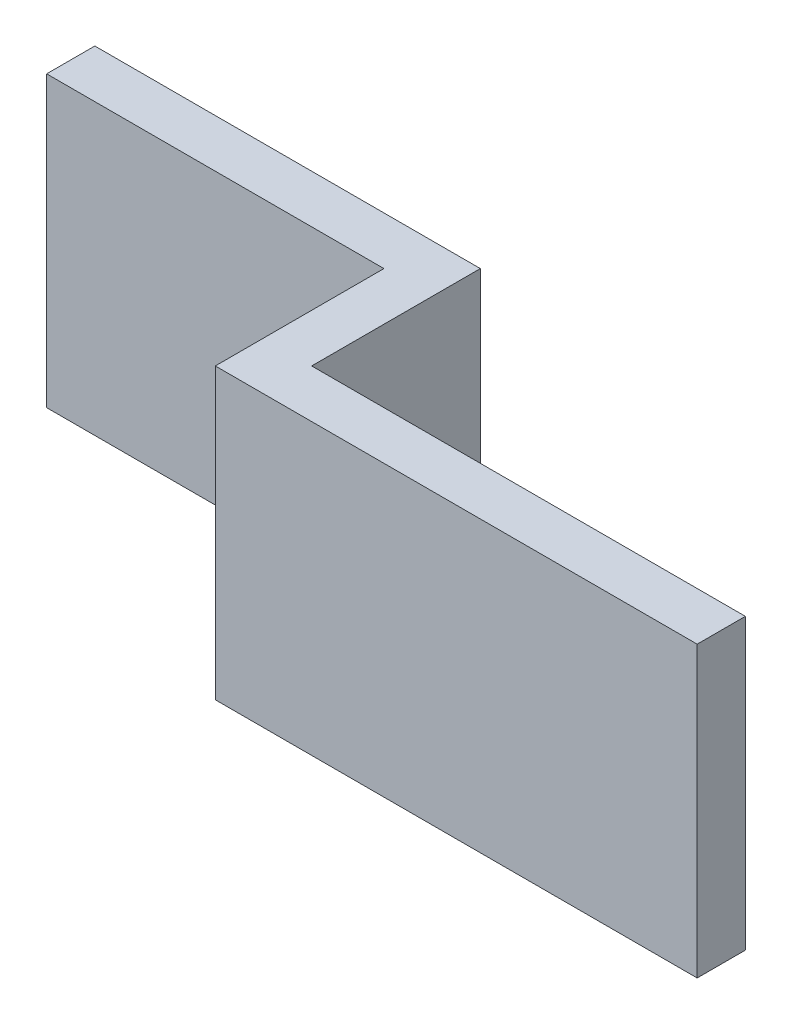
ISO-10303-21;
HEADER;
FILE_DESCRIPTION(('STEP AP214'),'2;1');
FILE_NAME('part.step','',(''),(''),'','','');
FILE_SCHEMA(('AUTOMOTIVE_DESIGN { 1 0 10303 214 1 1 1 1 }'));
ENDSEC;
DATA;
#1=APPLICATION_CONTEXT('core data for automotive mechanical design processes');
#2=APPLICATION_PROTOCOL_DEFINITION('international standard','automotive_design',2000,#1);
#3=PRODUCT_CONTEXT('',#1,'mechanical');
#4=PRODUCT('Part','Part','',(#3));
#5=PRODUCT_RELATED_PRODUCT_CATEGORY('part','',(#4));
#6=PRODUCT_DEFINITION_FORMATION('','',#4);
#7=PRODUCT_DEFINITION_CONTEXT('part definition',#1,'design');
#8=PRODUCT_DEFINITION('design','',#6,#7);
#9=PRODUCT_DEFINITION_SHAPE('','',#8);
#10=(LENGTH_UNIT() NAMED_UNIT(*) SI_UNIT(.MILLI.,.METRE.));
#11=(NAMED_UNIT(*) PLANE_ANGLE_UNIT() SI_UNIT($,.RADIAN.));
#12=(NAMED_UNIT(*) SI_UNIT($,.STERADIAN.) SOLID_ANGLE_UNIT());
#13=UNCERTAINTY_MEASURE_WITH_UNIT(LENGTH_MEASURE(1.E-05),#10,'distance_accuracy_value','');
#14=(GEOMETRIC_REPRESENTATION_CONTEXT(3) GLOBAL_UNCERTAINTY_ASSIGNED_CONTEXT((#13)) GLOBAL_UNIT_ASSIGNED_CONTEXT((#10,
#11,#12)) REPRESENTATION_CONTEXT('',''));
#15=CARTESIAN_POINT('',(0.,0.,0.));
#16=DIRECTION('',(0.,0.,1.));
#17=DIRECTION('',(1.,0.,0.));
#18=AXIS2_PLACEMENT_3D('',#15,#16,#17);
#19=CARTESIAN_POINT('',(0.,3.,-0.500000000000008));
#20=DIRECTION('',(0.,0.,1.));
#21=DIRECTION('',(1.,0.,0.));
#22=AXIS2_PLACEMENT_3D('',#19,#20,#21);
#23=PLANE('',#22);
#24=DIRECTION('',(-1.,0.,0.));
#25=VECTOR('',#24,1.);
#26=CARTESIAN_POINT('',(0.,-3.,-0.500000000000008));
#27=LINE('',#26,#25);
#28=CARTESIAN_POINT('',(1.,-3.,-0.5));
#29=VERTEX_POINT('',#28);
#30=CARTESIAN_POINT('',(-7.,-3.,-0.499999999999999));
#31=VERTEX_POINT('',#30);
#32=EDGE_CURVE('E132',#29,#31,#27,.T.);
#33=ORIENTED_EDGE('',*,*,#32,.T.);
#34=DIRECTION('',(0.,-1.,0.));
#35=VECTOR('',#34,1.);
#36=CARTESIAN_POINT('',(-7.,3.,-0.499999999999999));
#37=LINE('',#36,#35);
#38=CARTESIAN_POINT('',(-7.,3.,-0.499999999999999));
#39=VERTEX_POINT('',#38);
#40=EDGE_CURVE('E11',#39,#31,#37,.T.);
#41=ORIENTED_EDGE('',*,*,#40,.F.);
#42=DIRECTION('',(-1.,0.,0.));
#43=VECTOR('',#42,1.);
#44=CARTESIAN_POINT('',(0.,3.,-0.500000000000008));
#45=LINE('',#44,#43);
#46=CARTESIAN_POINT('',(1.,3.,-0.5));
#47=VERTEX_POINT('',#46);
#48=EDGE_CURVE('E151',#47,#39,#45,.T.);
#49=ORIENTED_EDGE('',*,*,#48,.F.);
#50=DIRECTION('',(0.,-1.,0.));
#51=VECTOR('',#50,1.);
#52=CARTESIAN_POINT('',(1.,3.,-0.5));
#53=LINE('',#52,#51);
#54=EDGE_CURVE('E50',#47,#29,#53,.T.);
#55=ORIENTED_EDGE('',*,*,#54,.T.);
#56=EDGE_LOOP('',(#33,#41,#49,#55));
#57=FACE_BOUND('',#56,.T.);
#58=ADVANCED_FACE('F34',(#57),#23,.F.);
#59=CARTESIAN_POINT('',(-7.,3.,0.));
#60=DIRECTION('',(1.,0.,0.));
#61=DIRECTION('',(0.,0.,-1.));
#62=AXIS2_PLACEMENT_3D('',#59,#60,#61);
#63=PLANE('',#62);
#64=DIRECTION('',(0.,0.,1.));
#65=VECTOR('',#64,1.);
#66=CARTESIAN_POINT('',(-7.,-3.,0.));
#67=LINE('',#66,#65);
#68=CARTESIAN_POINT('',(-7.,-3.,0.500000000000001));
#69=VERTEX_POINT('',#68);
#70=EDGE_CURVE('E134',#31,#69,#67,.T.);
#71=ORIENTED_EDGE('',*,*,#70,.T.);
#72=DIRECTION('',(0.,-1.,0.));
#73=VECTOR('',#72,1.);
#74=CARTESIAN_POINT('',(-7.,3.,0.500000000000001));
#75=LINE('',#74,#73);
#76=CARTESIAN_POINT('',(-7.,3.,0.500000000000001));
#77=VERTEX_POINT('',#76);
#78=EDGE_CURVE('E42',#77,#69,#75,.T.);
#79=ORIENTED_EDGE('',*,*,#78,.F.);
#80=DIRECTION('',(0.,0.,1.));
#81=VECTOR('',#80,1.);
#82=CARTESIAN_POINT('',(-7.,3.,0.));
#83=LINE('',#82,#81);
#84=EDGE_CURVE('E88',#39,#77,#83,.T.);
#85=ORIENTED_EDGE('',*,*,#84,.F.);
#86=ORIENTED_EDGE('',*,*,#40,.T.);
#87=EDGE_LOOP('',(#71,#79,#85,#86));
#88=FACE_BOUND('',#87,.T.);
#89=ADVANCED_FACE('F164',(#88),#63,.F.);
#90=CARTESIAN_POINT('',(0.,3.,0.500000000000008));
#91=DIRECTION('',(0.,0.,1.));
#92=DIRECTION('',(1.,0.,0.));
#93=AXIS2_PLACEMENT_3D('',#90,#91,#92);
#94=PLANE('',#93);
#95=DIRECTION('',(-1.,0.,0.));
#96=VECTOR('',#95,1.);
#97=CARTESIAN_POINT('',(0.,-3.,0.500000000000008));
#98=LINE('',#97,#96);
#99=CARTESIAN_POINT('',(0.,-3.,0.500000000000008));
#100=VERTEX_POINT('',#99);
#101=EDGE_CURVE('E137',#100,#69,#98,.T.);
#102=ORIENTED_EDGE('',*,*,#101,.F.);
#103=DIRECTION('',(0.,-1.,0.));
#104=VECTOR('',#103,1.);
#105=CARTESIAN_POINT('',(0.,3.,0.500000000000008));
#106=LINE('',#105,#104);
#107=CARTESIAN_POINT('',(0.,3.,0.500000000000008));
#108=VERTEX_POINT('',#107);
#109=EDGE_CURVE('E157',#108,#100,#106,.T.);
#110=ORIENTED_EDGE('',*,*,#109,.F.);
#111=DIRECTION('',(-1.,0.,0.));
#112=VECTOR('',#111,1.);
#113=CARTESIAN_POINT('',(0.,3.,0.500000000000008));
#114=LINE('',#113,#112);
#115=EDGE_CURVE('E163',#108,#77,#114,.T.);
#116=ORIENTED_EDGE('',*,*,#115,.T.);
#117=ORIENTED_EDGE('',*,*,#78,.T.);
#118=EDGE_LOOP('',(#102,#110,#116,#117));
#119=FACE_BOUND('',#118,.T.);
#120=ADVANCED_FACE('F161',(#119),#94,.T.);
#121=CARTESIAN_POINT('',(0.,3.,0.));
#122=DIRECTION('',(-1.,0.,0.));
#123=DIRECTION('',(0.,0.,1.));
#124=AXIS2_PLACEMENT_3D('',#121,#122,#123);
#125=PLANE('',#124);
#126=DIRECTION('',(0.,0.,-1.));
#127=VECTOR('',#126,1.);
#128=CARTESIAN_POINT('',(0.,-3.,0.));
#129=LINE('',#128,#127);
#130=CARTESIAN_POINT('',(0.,-3.,4.));
#131=VERTEX_POINT('',#130);
#132=EDGE_CURVE('E140',#131,#100,#129,.T.);
#133=ORIENTED_EDGE('',*,*,#132,.F.);
#134=DIRECTION('',(0.,-1.,0.));
#135=VECTOR('',#134,1.);
#136=CARTESIAN_POINT('',(0.,3.,4.));
#137=LINE('',#136,#135);
#138=CARTESIAN_POINT('',(0.,3.,4.));
#139=VERTEX_POINT('',#138);
#140=EDGE_CURVE('E155',#139,#131,#137,.T.);
#141=ORIENTED_EDGE('',*,*,#140,.F.);
#142=DIRECTION('',(0.,0.,-1.));
#143=VECTOR('',#142,1.);
#144=CARTESIAN_POINT('',(0.,3.,0.));
#145=LINE('',#144,#143);
#146=EDGE_CURVE('E173',#139,#108,#145,.T.);
#147=ORIENTED_EDGE('',*,*,#146,.T.);
#148=ORIENTED_EDGE('',*,*,#109,.T.);
#149=EDGE_LOOP('',(#133,#141,#147,#148));
#150=FACE_BOUND('',#149,.T.);
#151=ADVANCED_FACE('F171',(#150),#125,.T.);
#152=CARTESIAN_POINT('',(0.,3.,4.));
#153=DIRECTION('',(0.,0.,-1.));
#154=DIRECTION('',(-1.,0.,0.));
#155=AXIS2_PLACEMENT_3D('',#152,#153,#154);
#156=PLANE('',#155);
#157=DIRECTION('',(1.,0.,0.));
#158=VECTOR('',#157,1.);
#159=CARTESIAN_POINT('',(0.,-3.,4.));
#160=LINE('',#159,#158);
#161=CARTESIAN_POINT('',(10.,-3.,4.));
#162=VERTEX_POINT('',#161);
#163=EDGE_CURVE('E143',#131,#162,#160,.T.);
#164=ORIENTED_EDGE('',*,*,#163,.T.);
#165=DIRECTION('',(0.,-1.,0.));
#166=VECTOR('',#165,1.);
#167=CARTESIAN_POINT('',(10.,3.,4.));
#168=LINE('',#167,#166);
#169=CARTESIAN_POINT('',(10.,3.,4.));
#170=VERTEX_POINT('',#169);
#171=EDGE_CURVE('E124',#170,#162,#168,.T.);
#172=ORIENTED_EDGE('',*,*,#171,.F.);
#173=DIRECTION('',(1.,0.,0.));
#174=VECTOR('',#173,1.);
#175=CARTESIAN_POINT('',(0.,3.,4.));
#176=LINE('',#175,#174);
#177=EDGE_CURVE('E112',#139,#170,#176,.T.);
#178=ORIENTED_EDGE('',*,*,#177,.F.);
#179=ORIENTED_EDGE('',*,*,#140,.T.);
#180=EDGE_LOOP('',(#164,#172,#178,#179));
#181=FACE_BOUND('',#180,.T.);
#182=ADVANCED_FACE('F199',(#181),#156,.F.);
#183=CARTESIAN_POINT('',(10.,3.,0.));
#184=DIRECTION('',(-1.,0.,0.));
#185=DIRECTION('',(0.,0.,1.));
#186=AXIS2_PLACEMENT_3D('',#183,#184,#185);
#187=PLANE('',#186);
#188=DIRECTION('',(0.,0.,-1.));
#189=VECTOR('',#188,1.);
#190=CARTESIAN_POINT('',(10.,-3.,0.));
#191=LINE('',#190,#189);
#192=CARTESIAN_POINT('',(10.,-3.,3.));
#193=VERTEX_POINT('',#192);
#194=EDGE_CURVE('E121',#162,#193,#191,.T.);
#195=ORIENTED_EDGE('',*,*,#194,.T.);
#196=DIRECTION('',(0.,-1.,0.));
#197=VECTOR('',#196,1.);
#198=CARTESIAN_POINT('',(10.,3.,3.));
#199=LINE('',#198,#197);
#200=CARTESIAN_POINT('',(10.,3.,3.));
#201=VERTEX_POINT('',#200);
#202=EDGE_CURVE('E118',#201,#193,#199,.T.);
#203=ORIENTED_EDGE('',*,*,#202,.F.);
#204=DIRECTION('',(0.,0.,-1.));
#205=VECTOR('',#204,1.);
#206=CARTESIAN_POINT('',(10.,3.,0.));
#207=LINE('',#206,#205);
#208=EDGE_CURVE('E104',#170,#201,#207,.T.);
#209=ORIENTED_EDGE('',*,*,#208,.F.);
#210=ORIENTED_EDGE('',*,*,#171,.T.);
#211=EDGE_LOOP('',(#195,#203,#209,#210));
#212=FACE_BOUND('',#211,.T.);
#213=ADVANCED_FACE('F119',(#212),#187,.F.);
#214=CARTESIAN_POINT('',(0.,3.,3.));
#215=DIRECTION('',(0.,0.,-1.));
#216=DIRECTION('',(-1.,0.,0.));
#217=AXIS2_PLACEMENT_3D('',#214,#215,#216);
#218=PLANE('',#217);
#219=DIRECTION('',(1.,0.,0.));
#220=VECTOR('',#219,1.);
#221=CARTESIAN_POINT('',(0.,-3.,3.));
#222=LINE('',#221,#220);
#223=CARTESIAN_POINT('',(1.,-3.,3.));
#224=VERTEX_POINT('',#223);
#225=EDGE_CURVE('E146',#224,#193,#222,.T.);
#226=ORIENTED_EDGE('',*,*,#225,.F.);
#227=DIRECTION('',(0.,-1.,0.));
#228=VECTOR('',#227,1.);
#229=CARTESIAN_POINT('',(1.,3.,3.));
#230=LINE('',#229,#228);
#231=CARTESIAN_POINT('',(1.,3.,3.));
#232=VERTEX_POINT('',#231);
#233=EDGE_CURVE('E76',#232,#224,#230,.T.);
#234=ORIENTED_EDGE('',*,*,#233,.F.);
#235=DIRECTION('',(1.,0.,0.));
#236=VECTOR('',#235,1.);
#237=CARTESIAN_POINT('',(0.,3.,3.));
#238=LINE('',#237,#236);
#239=EDGE_CURVE('E109',#232,#201,#238,.T.);
#240=ORIENTED_EDGE('',*,*,#239,.T.);
#241=ORIENTED_EDGE('',*,*,#202,.T.);
#242=EDGE_LOOP('',(#226,#234,#240,#241));
#243=FACE_BOUND('',#242,.T.);
#244=ADVANCED_FACE('F126',(#243),#218,.T.);
#245=CARTESIAN_POINT('',(1.,3.,0.));
#246=DIRECTION('',(1.,0.,0.));
#247=DIRECTION('',(0.,0.,-1.));
#248=AXIS2_PLACEMENT_3D('',#245,#246,#247);
#249=PLANE('',#248);
#250=DIRECTION('',(0.,0.,1.));
#251=VECTOR('',#250,1.);
#252=CARTESIAN_POINT('',(1.,-3.,0.));
#253=LINE('',#252,#251);
#254=EDGE_CURVE('E148',#29,#224,#253,.T.);
#255=ORIENTED_EDGE('',*,*,#254,.F.);
#256=ORIENTED_EDGE('',*,*,#54,.F.);
#257=DIRECTION('',(0.,0.,1.));
#258=VECTOR('',#257,1.);
#259=CARTESIAN_POINT('',(1.,3.,0.));
#260=LINE('',#259,#258);
#261=EDGE_CURVE('E127',#47,#232,#260,.T.);
#262=ORIENTED_EDGE('',*,*,#261,.T.);
#263=ORIENTED_EDGE('',*,*,#233,.T.);
#264=EDGE_LOOP('',(#255,#256,#262,#263));
#265=FACE_BOUND('',#264,.T.);
#266=ADVANCED_FACE('F178',(#265),#249,.T.);
#267=CARTESIAN_POINT('',(0.,3.,0.));
#268=DIRECTION('',(0.,1.,0.));
#269=DIRECTION('',(0.,0.,1.));
#270=AXIS2_PLACEMENT_3D('',#267,#268,#269);
#271=PLANE('',#270);
#272=ORIENTED_EDGE('',*,*,#48,.T.);
#273=ORIENTED_EDGE('',*,*,#84,.T.);
#274=ORIENTED_EDGE('',*,*,#115,.F.);
#275=ORIENTED_EDGE('',*,*,#146,.F.);
#276=ORIENTED_EDGE('',*,*,#177,.T.);
#277=ORIENTED_EDGE('',*,*,#208,.T.);
#278=ORIENTED_EDGE('',*,*,#239,.F.);
#279=ORIENTED_EDGE('',*,*,#261,.F.);
#280=EDGE_LOOP('',(#272,#273,#274,#275,#276,#277,#278,#279));
#281=FACE_BOUND('',#280,.T.);
#282=ADVANCED_FACE('F106',(#281),#271,.T.);
#283=CARTESIAN_POINT('',(0.,-3.,0.));
#284=DIRECTION('',(0.,1.,0.));
#285=DIRECTION('',(0.,0.,1.));
#286=AXIS2_PLACEMENT_3D('',#283,#284,#285);
#287=PLANE('',#286);
#288=ORIENTED_EDGE('',*,*,#32,.F.);
#289=ORIENTED_EDGE('',*,*,#254,.T.);
#290=ORIENTED_EDGE('',*,*,#225,.T.);
#291=ORIENTED_EDGE('',*,*,#194,.F.);
#292=ORIENTED_EDGE('',*,*,#163,.F.);
#293=ORIENTED_EDGE('',*,*,#132,.T.);
#294=ORIENTED_EDGE('',*,*,#101,.T.);
#295=ORIENTED_EDGE('',*,*,#70,.F.);
#296=EDGE_LOOP('',(#288,#289,#290,#291,#292,#293,#294,#295));
#297=FACE_BOUND('',#296,.T.);
#298=ADVANCED_FACE('F167',(#297),#287,.F.);
#299=CLOSED_SHELL('',(#58,#89,#120,#151,#182,#213,#244,#266,#282,#298));
#300=MANIFOLD_SOLID_BREP('B2',#299);
#301=ADVANCED_BREP_SHAPE_REPRESENTATION('',(#18,#300),#14);
#302=SHAPE_DEFINITION_REPRESENTATION(#9,#301);
ENDSEC;
END-ISO-10303-21;
